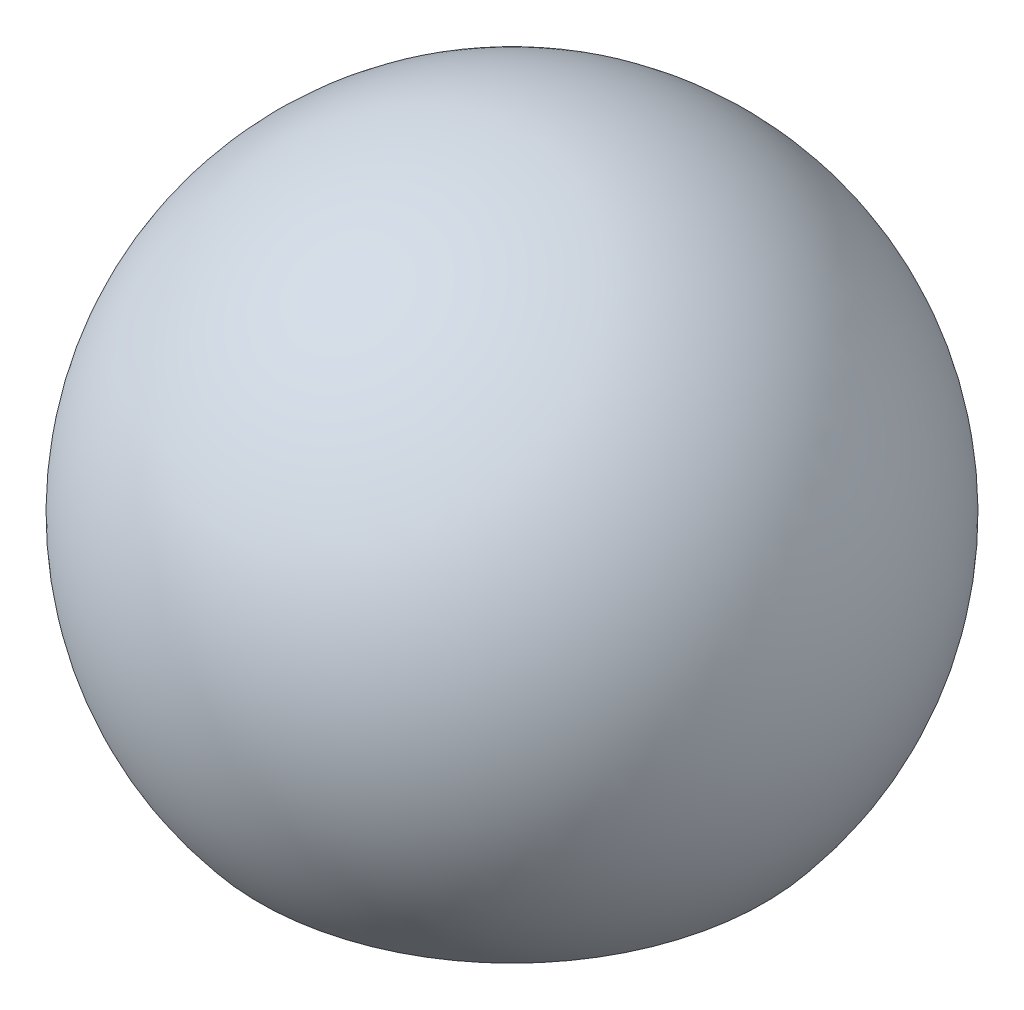
ISO-10303-21;
HEADER;
FILE_DESCRIPTION(('STEP AP214'),'2;1');
FILE_NAME('part.step','',(''),(''),'','','');
FILE_SCHEMA(('AUTOMOTIVE_DESIGN { 1 0 10303 214 1 1 1 1 }'));
ENDSEC;
DATA;
#1=APPLICATION_CONTEXT('core data for automotive mechanical design processes');
#2=APPLICATION_PROTOCOL_DEFINITION('international standard','automotive_design',2000,#1);
#3=PRODUCT_CONTEXT('',#1,'mechanical');
#4=PRODUCT('Part','Part','',(#3));
#5=PRODUCT_RELATED_PRODUCT_CATEGORY('part','',(#4));
#6=PRODUCT_DEFINITION_FORMATION('','',#4);
#7=PRODUCT_DEFINITION_CONTEXT('part definition',#1,'design');
#8=PRODUCT_DEFINITION('design','',#6,#7);
#9=PRODUCT_DEFINITION_SHAPE('','',#8);
#10=(LENGTH_UNIT() NAMED_UNIT(*) SI_UNIT(.MILLI.,.METRE.));
#11=(NAMED_UNIT(*) PLANE_ANGLE_UNIT() SI_UNIT($,.RADIAN.));
#12=(NAMED_UNIT(*) SI_UNIT($,.STERADIAN.) SOLID_ANGLE_UNIT());
#13=UNCERTAINTY_MEASURE_WITH_UNIT(LENGTH_MEASURE(1.E-05),#10,'distance_accuracy_value','');
#14=(GEOMETRIC_REPRESENTATION_CONTEXT(3) GLOBAL_UNCERTAINTY_ASSIGNED_CONTEXT((#13)) GLOBAL_UNIT_ASSIGNED_CONTEXT((#10,
#11,#12)) REPRESENTATION_CONTEXT('',''));
#15=CARTESIAN_POINT('',(0.,0.,0.));
#16=DIRECTION('',(0.,0.,1.));
#17=DIRECTION('',(1.,0.,0.));
#18=AXIS2_PLACEMENT_3D('',#15,#16,#17);
#19=CARTESIAN_POINT('',(0.,600.,0.));
#20=DIRECTION('',(0.,-1.,0.));
#21=DIRECTION('',(-1.,0.,0.));
#22=AXIS2_PLACEMENT_3D('',#19,#20,#21);
#23=SPHERICAL_SURFACE('',#22,1700.);
#24=CARTESIAN_POINT('',(0.,-492.738936467123,0.));
#25=DIRECTION('',(0.,-1.,0.));
#26=DIRECTION('',(0.,0.,-1.));
#27=AXIS2_PLACEMENT_3D('',#24,#25,#26);
#28=CIRCLE('',#27,1302.27555330226);
#29=CARTESIAN_POINT('',(0.,-492.738936467123,-1302.27555330226));
#30=VERTEX_POINT('',#29);
#31=EDGE_CURVE('E48',#30,#30,#28,.T.);
#32=ORIENTED_EDGE('',*,*,#31,.F.);
#33=EDGE_LOOP('',(#32));
#34=FACE_BOUND('',#33,.T.);
#35=ADVANCED_FACE('F41',(#34),#23,.T.);
#36=CARTESIAN_POINT('',(0.,600.,0.));
#37=DIRECTION('',(0.,-1.,0.));
#38=DIRECTION('',(-1.,0.,0.));
#39=AXIS2_PLACEMENT_3D('',#36,#37,#38);
#40=SPHERICAL_SURFACE('',#39,700.);
#41=CARTESIAN_POINT('',(0.,150.04867321942,0.));
#42=DIRECTION('',(0.,-1.,0.));
#43=DIRECTION('',(0.,0.,-1.));
#44=AXIS2_PLACEMENT_3D('',#41,#42,#43);
#45=CIRCLE('',#44,536.231110183282);
#46=CARTESIAN_POINT('',(0.,150.04867321942,-536.231110183282));
#47=VERTEX_POINT('',#46);
#48=EDGE_CURVE('E10',#47,#47,#45,.T.);
#49=ORIENTED_EDGE('',*,*,#48,.T.);
#50=EDGE_LOOP('',(#49));
#51=FACE_BOUND('',#50,.T.);
#52=ADVANCED_FACE('F59',(#51),#40,.F.);
#53=CARTESIAN_POINT('',(0.,150.04867321942,0.));
#54=DIRECTION('',(0.,-1.,0.));
#55=DIRECTION('',(0.,0.,-1.));
#56=AXIS2_PLACEMENT_3D('',#53,#54,#55);
#57=CONICAL_SURFACE('',#56,536.231110183282,0.87266462599716);
#58=ORIENTED_EDGE('',*,*,#31,.T.);
#59=EDGE_LOOP('',(#58));
#60=FACE_BOUND('',#59,.T.);
#61=ORIENTED_EDGE('',*,*,#48,.F.);
#62=EDGE_LOOP('',(#61));
#63=FACE_BOUND('',#62,.T.);
#64=ADVANCED_FACE('F55',(#60,#63),#57,.F.);
#65=CLOSED_SHELL('',(#35,#52,#64));
#66=MANIFOLD_SOLID_BREP('B2',#65);
#67=ADVANCED_BREP_SHAPE_REPRESENTATION('',(#18,#66),#14);
#68=SHAPE_DEFINITION_REPRESENTATION(#9,#67);
ENDSEC;
END-ISO-10303-21;
